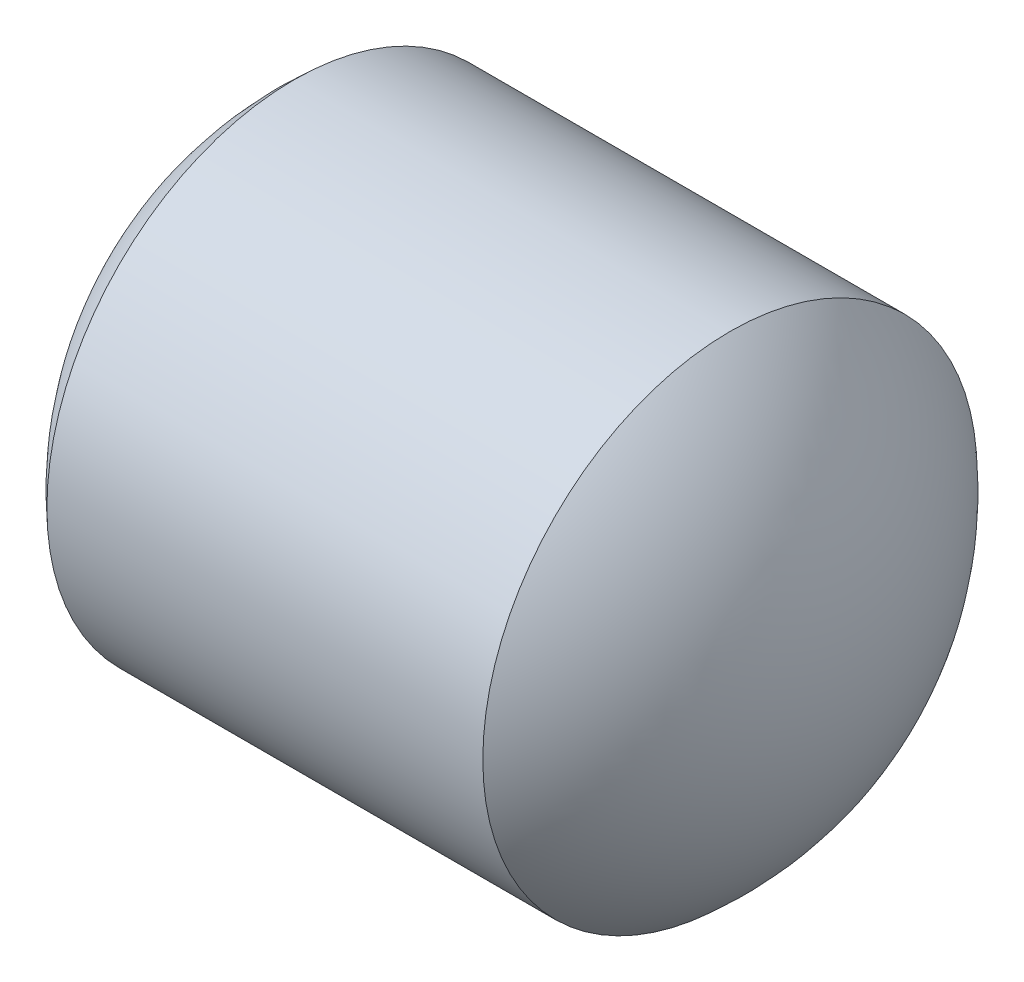
ISO-10303-21;
HEADER;
FILE_DESCRIPTION(('STEP AP214'),'2;1');
FILE_NAME('part.step','',(''),(''),'','','');
FILE_SCHEMA(('AUTOMOTIVE_DESIGN { 1 0 10303 214 1 1 1 1 }'));
ENDSEC;
DATA;
#1=APPLICATION_CONTEXT('core data for automotive mechanical design processes');
#2=APPLICATION_PROTOCOL_DEFINITION('international standard','automotive_design',2000,#1);
#3=PRODUCT_CONTEXT('',#1,'mechanical');
#4=PRODUCT('Part','Part','',(#3));
#5=PRODUCT_RELATED_PRODUCT_CATEGORY('part','',(#4));
#6=PRODUCT_DEFINITION_FORMATION('','',#4);
#7=PRODUCT_DEFINITION_CONTEXT('part definition',#1,'design');
#8=PRODUCT_DEFINITION('design','',#6,#7);
#9=PRODUCT_DEFINITION_SHAPE('','',#8);
#10=(LENGTH_UNIT() NAMED_UNIT(*) SI_UNIT(.MILLI.,.METRE.));
#11=(NAMED_UNIT(*) PLANE_ANGLE_UNIT() SI_UNIT($,.RADIAN.));
#12=(NAMED_UNIT(*) SI_UNIT($,.STERADIAN.) SOLID_ANGLE_UNIT());
#13=UNCERTAINTY_MEASURE_WITH_UNIT(LENGTH_MEASURE(1.E-05),#10,'distance_accuracy_value','');
#14=(GEOMETRIC_REPRESENTATION_CONTEXT(3) GLOBAL_UNCERTAINTY_ASSIGNED_CONTEXT((#13)) GLOBAL_UNIT_ASSIGNED_CONTEXT((#10,
#11,#12)) REPRESENTATION_CONTEXT('',''));
#15=CARTESIAN_POINT('',(0.,0.,0.));
#16=DIRECTION('',(0.,0.,1.));
#17=DIRECTION('',(1.,0.,0.));
#18=AXIS2_PLACEMENT_3D('',#15,#16,#17);
#19=CARTESIAN_POINT('',(227.543530696246,133.344863749728,0.));
#20=DIRECTION('',(-1.,0.,0.));
#21=DIRECTION('',(0.,0.,1.));
#22=AXIS2_PLACEMENT_3D('',#19,#20,#21);
#23=CYLINDRICAL_SURFACE('',#22,1.50000000000002);
#24=CARTESIAN_POINT('',(231.022224229877,133.344863749728,0.));
#25=DIRECTION('',(-1.,0.,0.));
#26=DIRECTION('',(0.,0.,1.));
#27=AXIS2_PLACEMENT_3D('',#24,#25,#26);
#28=CIRCLE('',#27,1.50000000000003);
#29=CARTESIAN_POINT('',(231.022224229877,133.344863749728,1.50000000000003));
#30=VERTEX_POINT('',#29);
#31=EDGE_CURVE('E41',#30,#30,#28,.T.);
#32=ORIENTED_EDGE('',*,*,#31,.T.);
#33=EDGE_LOOP('',(#32));
#34=FACE_BOUND('',#33,.T.);
#35=CARTESIAN_POINT('',(228.376472918813,133.344863749728,0.));
#36=DIRECTION('',(-1.,0.,0.));
#37=DIRECTION('',(0.,0.,1.));
#38=AXIS2_PLACEMENT_3D('',#35,#36,#37);
#39=CIRCLE('',#38,1.5);
#40=CARTESIAN_POINT('',(228.376472918813,133.344863749728,1.5));
#41=VERTEX_POINT('',#40);
#42=EDGE_CURVE('E10',#41,#41,#39,.T.);
#43=ORIENTED_EDGE('',*,*,#42,.F.);
#44=EDGE_LOOP('',(#43));
#45=FACE_BOUND('',#44,.T.);
#46=ADVANCED_FACE('F35',(#34,#45),#23,.T.);
#47=CARTESIAN_POINT('',(229.699348574345,133.344863749728,0.));
#48=DIRECTION('',(-1.,0.,0.));
#49=DIRECTION('',(0.,1.,0.));
#50=AXIS2_PLACEMENT_3D('',#47,#48,#49);
#51=SPHERICAL_SURFACE('',#50,2.);
#52=ORIENTED_EDGE('',*,*,#42,.T.);
#53=EDGE_LOOP('',(#52));
#54=FACE_BOUND('',#53,.T.);
#55=ADVANCED_FACE('F51',(#54),#51,.T.);
#56=CARTESIAN_POINT('',(229.699348574345,133.344863749728,0.));
#57=DIRECTION('',(-1.,0.,0.));
#58=DIRECTION('',(0.,1.,0.));
#59=AXIS2_PLACEMENT_3D('',#56,#57,#58);
#60=SPHERICAL_SURFACE('',#59,1.99999999999999);
#61=ORIENTED_EDGE('',*,*,#31,.F.);
#62=EDGE_LOOP('',(#61));
#63=FACE_BOUND('',#62,.T.);
#64=ADVANCED_FACE('F49',(#63),#60,.T.);
#65=CLOSED_SHELL('',(#46,#55,#64));
#66=MANIFOLD_SOLID_BREP('B2',#65);
#67=ADVANCED_BREP_SHAPE_REPRESENTATION('',(#18,#66),#14);
#68=SHAPE_DEFINITION_REPRESENTATION(#9,#67);
ENDSEC;
END-ISO-10303-21;
